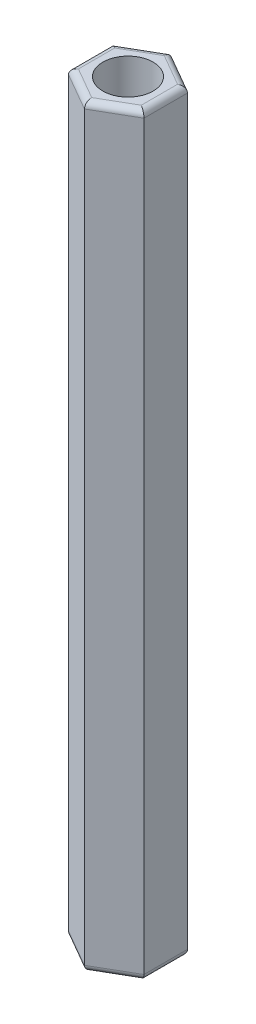
ISO-10303-21;
HEADER;
FILE_DESCRIPTION(('STEP AP214'),'2;1');
FILE_NAME('part.step','',(''),(''),'','','');
FILE_SCHEMA(('AUTOMOTIVE_DESIGN { 1 0 10303 214 1 1 1 1 }'));
ENDSEC;
DATA;
#1=APPLICATION_CONTEXT('core data for automotive mechanical design processes');
#2=APPLICATION_PROTOCOL_DEFINITION('international standard','automotive_design',2000,#1);
#3=PRODUCT_CONTEXT('',#1,'mechanical');
#4=PRODUCT('Part','Part','',(#3));
#5=PRODUCT_RELATED_PRODUCT_CATEGORY('part','',(#4));
#6=PRODUCT_DEFINITION_FORMATION('','',#4);
#7=PRODUCT_DEFINITION_CONTEXT('part definition',#1,'design');
#8=PRODUCT_DEFINITION('design','',#6,#7);
#9=PRODUCT_DEFINITION_SHAPE('','',#8);
#10=(LENGTH_UNIT() NAMED_UNIT(*) SI_UNIT(.MILLI.,.METRE.));
#11=(NAMED_UNIT(*) PLANE_ANGLE_UNIT() SI_UNIT($,.RADIAN.));
#12=(NAMED_UNIT(*) SI_UNIT($,.STERADIAN.) SOLID_ANGLE_UNIT());
#13=UNCERTAINTY_MEASURE_WITH_UNIT(LENGTH_MEASURE(1.E-05),#10,'distance_accuracy_value','');
#14=(GEOMETRIC_REPRESENTATION_CONTEXT(3) GLOBAL_UNCERTAINTY_ASSIGNED_CONTEXT((#13)) GLOBAL_UNIT_ASSIGNED_CONTEXT((#10,
#11,#12)) REPRESENTATION_CONTEXT('',''));
#15=CARTESIAN_POINT('',(0.,0.,0.));
#16=DIRECTION('',(0.,0.,1.));
#17=DIRECTION('',(1.,0.,0.));
#18=AXIS2_PLACEMENT_3D('',#15,#16,#17);
#19=CARTESIAN_POINT('',(0.,60.,0.));
#20=DIRECTION('',(0.,1.,0.));
#21=DIRECTION('',(0.,0.,1.));
#22=AXIS2_PLACEMENT_3D('',#19,#20,#21);
#23=PLANE('',#22);
#24=DIRECTION('',(0.,0.,1.));
#25=VECTOR('',#24,1.);
#26=CARTESIAN_POINT('',(-2.5,60.,1.73205080756888));
#27=LINE('',#26,#25);
#28=CARTESIAN_POINT('',(-2.5,60.,-1.44337567297407));
#29=VERTEX_POINT('',#28);
#30=CARTESIAN_POINT('',(-2.5,60.,1.44337567297406));
#31=VERTEX_POINT('',#30);
#32=EDGE_CURVE('E44',#29,#31,#27,.T.);
#33=ORIENTED_EDGE('',*,*,#32,.T.);
#34=DIRECTION('',(0.866025403784439,0.,0.5));
#35=VECTOR('',#34,1.);
#36=CARTESIAN_POINT('',(0.249999999999999,60.,3.03108891324554));
#37=LINE('',#36,#35);
#38=CARTESIAN_POINT('',(0.,60.,2.88675134594813));
#39=VERTEX_POINT('',#38);
#40=EDGE_CURVE('E11',#31,#39,#37,.T.);
#41=ORIENTED_EDGE('',*,*,#40,.T.);
#42=DIRECTION('',(0.866025403784439,0.,-0.5));
#43=VECTOR('',#42,1.);
#44=CARTESIAN_POINT('',(2.75,60.,1.29903810567666));
#45=LINE('',#44,#43);
#46=CARTESIAN_POINT('',(2.5,60.,1.44337567297406));
#47=VERTEX_POINT('',#46);
#48=EDGE_CURVE('E160',#39,#47,#45,.T.);
#49=ORIENTED_EDGE('',*,*,#48,.T.);
#50=DIRECTION('',(0.,0.,-1.));
#51=VECTOR('',#50,1.);
#52=CARTESIAN_POINT('',(2.5,60.,-1.73205080756888));
#53=LINE('',#52,#51);
#54=CARTESIAN_POINT('',(2.5,60.,-1.44337567297407));
#55=VERTEX_POINT('',#54);
#56=EDGE_CURVE('E257',#47,#55,#53,.T.);
#57=ORIENTED_EDGE('',*,*,#56,.T.);
#58=DIRECTION('',(-0.866025403784439,0.,-0.5));
#59=VECTOR('',#58,1.);
#60=CARTESIAN_POINT('',(-0.250000000000001,60.,-3.03108891324554));
#61=LINE('',#60,#59);
#62=CARTESIAN_POINT('',(0.,60.,-2.88675134594813));
#63=VERTEX_POINT('',#62);
#64=EDGE_CURVE('E259',#55,#63,#61,.T.);
#65=ORIENTED_EDGE('',*,*,#64,.T.);
#66=DIRECTION('',(-0.866025403784439,0.,0.5));
#67=VECTOR('',#66,1.);
#68=CARTESIAN_POINT('',(-2.75,60.,-1.29903810567666));
#69=LINE('',#68,#67);
#70=EDGE_CURVE('E55',#63,#29,#69,.T.);
#71=ORIENTED_EDGE('',*,*,#70,.T.);
#72=EDGE_LOOP('',(#33,#41,#49,#57,#65,#71));
#73=FACE_BOUND('',#72,.T.);
#74=CARTESIAN_POINT('',(0.,60.,0.));
#75=DIRECTION('',(0.,1.,0.));
#76=DIRECTION('',(0.,0.,1.));
#77=AXIS2_PLACEMENT_3D('',#74,#75,#76);
#78=CIRCLE('',#77,2.);
#79=CARTESIAN_POINT('',(0.,60.,2.));
#80=VERTEX_POINT('',#79);
#81=EDGE_CURVE('E149',#80,#80,#78,.T.);
#82=ORIENTED_EDGE('',*,*,#81,.F.);
#83=EDGE_LOOP('',(#82));
#84=FACE_BOUND('',#83,.T.);
#85=ADVANCED_FACE('F35',(#73,#84),#23,.T.);
#86=CARTESIAN_POINT('',(0.,0.,0.));
#87=DIRECTION('',(0.,1.,0.));
#88=DIRECTION('',(0.,0.,1.));
#89=AXIS2_PLACEMENT_3D('',#86,#87,#88);
#90=PLANE('',#89);
#91=DIRECTION('',(0.866025403784439,0.,-0.5));
#92=VECTOR('',#91,1.);
#93=CARTESIAN_POINT('',(1.25,0.,2.1650635094611));
#94=LINE('',#93,#92);
#95=CARTESIAN_POINT('',(2.5,0.,1.44337567297406));
#96=VERTEX_POINT('',#95);
#97=CARTESIAN_POINT('',(0.,0.,2.88675134594813));
#98=VERTEX_POINT('',#97);
#99=EDGE_CURVE('E235',#96,#98,#94,.F.);
#100=ORIENTED_EDGE('',*,*,#99,.T.);
#101=DIRECTION('',(0.866025403784439,0.,0.5));
#102=VECTOR('',#101,1.);
#103=CARTESIAN_POINT('',(-1.25,0.,2.1650635094611));
#104=LINE('',#103,#102);
#105=CARTESIAN_POINT('',(-2.5,0.,1.44337567297406));
#106=VERTEX_POINT('',#105);
#107=EDGE_CURVE('E136',#98,#106,#104,.F.);
#108=ORIENTED_EDGE('',*,*,#107,.T.);
#109=DIRECTION('',(0.,0.,1.));
#110=VECTOR('',#109,1.);
#111=CARTESIAN_POINT('',(-2.5,0.,0.));
#112=LINE('',#111,#110);
#113=CARTESIAN_POINT('',(-2.5,0.,-1.44337567297407));
#114=VERTEX_POINT('',#113);
#115=EDGE_CURVE('E227',#106,#114,#112,.F.);
#116=ORIENTED_EDGE('',*,*,#115,.T.);
#117=DIRECTION('',(-0.866025403784439,0.,0.5));
#118=VECTOR('',#117,1.);
#119=CARTESIAN_POINT('',(-1.25,0.,-2.1650635094611));
#120=LINE('',#119,#118);
#121=CARTESIAN_POINT('',(0.,0.,-2.88675134594813));
#122=VERTEX_POINT('',#121);
#123=EDGE_CURVE('E229',#114,#122,#120,.F.);
#124=ORIENTED_EDGE('',*,*,#123,.T.);
#125=DIRECTION('',(-0.866025403784439,0.,-0.5));
#126=VECTOR('',#125,1.);
#127=CARTESIAN_POINT('',(1.25,0.,-2.1650635094611));
#128=LINE('',#127,#126);
#129=CARTESIAN_POINT('',(2.5,0.,-1.44337567297407));
#130=VERTEX_POINT('',#129);
#131=EDGE_CURVE('E231',#122,#130,#128,.F.);
#132=ORIENTED_EDGE('',*,*,#131,.T.);
#133=DIRECTION('',(0.,0.,-1.));
#134=VECTOR('',#133,1.);
#135=CARTESIAN_POINT('',(2.5,0.,0.));
#136=LINE('',#135,#134);
#137=EDGE_CURVE('E233',#130,#96,#136,.F.);
#138=ORIENTED_EDGE('',*,*,#137,.T.);
#139=EDGE_LOOP('',(#100,#108,#116,#124,#132,#138));
#140=FACE_BOUND('',#139,.T.);
#141=CARTESIAN_POINT('',(0.,0.,0.));
#142=DIRECTION('',(0.,1.,0.));
#143=DIRECTION('',(0.,0.,1.));
#144=AXIS2_PLACEMENT_3D('',#141,#142,#143);
#145=CIRCLE('',#144,2.);
#146=CARTESIAN_POINT('',(0.,0.,2.));
#147=VERTEX_POINT('',#146);
#148=EDGE_CURVE('E203',#147,#147,#145,.T.);
#149=ORIENTED_EDGE('',*,*,#148,.T.);
#150=EDGE_LOOP('',(#149));
#151=FACE_BOUND('',#150,.T.);
#152=ADVANCED_FACE('F303',(#140,#151),#90,.F.);
#153=CARTESIAN_POINT('',(0.,60.,3.46410161513776));
#154=DIRECTION('',(-0.5,0.,-0.866025403784438));
#155=DIRECTION('',(-0.866025403784439,0.,0.5));
#156=AXIS2_PLACEMENT_3D('',#153,#154,#155);
#157=PLANE('',#156);
#158=DIRECTION('',(0.,-1.,0.));
#159=VECTOR('',#158,1.);
#160=CARTESIAN_POINT('',(0.,60.,3.46410161513776));
#161=LINE('',#160,#159);
#162=CARTESIAN_POINT('',(0.,59.5,3.46410161513776));
#163=VERTEX_POINT('',#162);
#164=CARTESIAN_POINT('',(0.,0.5,3.46410161513776));
#165=VERTEX_POINT('',#164);
#166=EDGE_CURVE('E128',#163,#165,#161,.T.);
#167=ORIENTED_EDGE('',*,*,#166,.T.);
#168=DIRECTION('',(0.866025403784439,0.,-0.5));
#169=VECTOR('',#168,1.);
#170=CARTESIAN_POINT('',(0.,0.5,3.46410161513776));
#171=LINE('',#170,#169);
#172=CARTESIAN_POINT('',(3.,0.5,1.73205080756888));
#173=VERTEX_POINT('',#172);
#174=EDGE_CURVE('E135',#165,#173,#171,.T.);
#175=ORIENTED_EDGE('',*,*,#174,.T.);
#176=DIRECTION('',(0.,-1.,0.));
#177=VECTOR('',#176,1.);
#178=CARTESIAN_POINT('',(3.,60.,1.73205080756888));
#179=LINE('',#178,#177);
#180=CARTESIAN_POINT('',(3.,59.5,1.73205080756888));
#181=VERTEX_POINT('',#180);
#182=EDGE_CURVE('E130',#181,#173,#179,.T.);
#183=ORIENTED_EDGE('',*,*,#182,.F.);
#184=DIRECTION('',(0.866025403784439,0.,-0.5));
#185=VECTOR('',#184,1.);
#186=CARTESIAN_POINT('',(0.,59.5,3.46410161513776));
#187=LINE('',#186,#185);
#188=EDGE_CURVE('E125',#181,#163,#187,.F.);
#189=ORIENTED_EDGE('',*,*,#188,.T.);
#190=EDGE_LOOP('',(#167,#175,#183,#189));
#191=FACE_BOUND('',#190,.T.);
#192=ADVANCED_FACE('F127',(#191),#157,.F.);
#193=CARTESIAN_POINT('',(3.,60.,1.73205080756888));
#194=DIRECTION('',(-1.,0.,0.));
#195=DIRECTION('',(0.,0.,1.));
#196=AXIS2_PLACEMENT_3D('',#193,#194,#195);
#197=PLANE('',#196);
#198=ORIENTED_EDGE('',*,*,#182,.T.);
#199=DIRECTION('',(0.,0.,-1.));
#200=VECTOR('',#199,1.);
#201=CARTESIAN_POINT('',(3.,0.5,1.73205080756888));
#202=LINE('',#201,#200);
#203=CARTESIAN_POINT('',(3.,0.5,-1.73205080756888));
#204=VERTEX_POINT('',#203);
#205=EDGE_CURVE('E242',#173,#204,#202,.T.);
#206=ORIENTED_EDGE('',*,*,#205,.T.);
#207=DIRECTION('',(0.,-1.,0.));
#208=VECTOR('',#207,1.);
#209=CARTESIAN_POINT('',(3.,60.,-1.73205080756888));
#210=LINE('',#209,#208);
#211=CARTESIAN_POINT('',(3.,59.5,-1.73205080756888));
#212=VERTEX_POINT('',#211);
#213=EDGE_CURVE('E222',#212,#204,#210,.T.);
#214=ORIENTED_EDGE('',*,*,#213,.F.);
#215=DIRECTION('',(0.,0.,-1.));
#216=VECTOR('',#215,1.);
#217=CARTESIAN_POINT('',(3.,59.5,1.73205080756888));
#218=LINE('',#217,#216);
#219=EDGE_CURVE('E240',#212,#181,#218,.F.);
#220=ORIENTED_EDGE('',*,*,#219,.T.);
#221=EDGE_LOOP('',(#198,#206,#214,#220));
#222=FACE_BOUND('',#221,.T.);
#223=ADVANCED_FACE('F271',(#222),#197,.F.);
#224=CARTESIAN_POINT('',(3.,60.,-1.73205080756888));
#225=DIRECTION('',(-0.5,0.,0.866025403784438));
#226=DIRECTION('',(0.866025403784439,0.,0.5));
#227=AXIS2_PLACEMENT_3D('',#224,#225,#226);
#228=PLANE('',#227);
#229=ORIENTED_EDGE('',*,*,#213,.T.);
#230=DIRECTION('',(-0.866025403784439,0.,-0.5));
#231=VECTOR('',#230,1.);
#232=CARTESIAN_POINT('',(3.,0.5,-1.73205080756888));
#233=LINE('',#232,#231);
#234=CARTESIAN_POINT('',(0.,0.5,-3.46410161513776));
#235=VERTEX_POINT('',#234);
#236=EDGE_CURVE('E246',#204,#235,#233,.T.);
#237=ORIENTED_EDGE('',*,*,#236,.T.);
#238=DIRECTION('',(0.,-1.,0.));
#239=VECTOR('',#238,1.);
#240=CARTESIAN_POINT('',(0.,60.,-3.46410161513776));
#241=LINE('',#240,#239);
#242=CARTESIAN_POINT('',(0.,59.5,-3.46410161513776));
#243=VERTEX_POINT('',#242);
#244=EDGE_CURVE('E219',#243,#235,#241,.T.);
#245=ORIENTED_EDGE('',*,*,#244,.F.);
#246=DIRECTION('',(-0.866025403784439,0.,-0.5));
#247=VECTOR('',#246,1.);
#248=CARTESIAN_POINT('',(3.,59.5,-1.73205080756888));
#249=LINE('',#248,#247);
#250=EDGE_CURVE('E244',#243,#212,#249,.F.);
#251=ORIENTED_EDGE('',*,*,#250,.T.);
#252=EDGE_LOOP('',(#229,#237,#245,#251));
#253=FACE_BOUND('',#252,.T.);
#254=ADVANCED_FACE('F274',(#253),#228,.F.);
#255=CARTESIAN_POINT('',(0.,60.,-3.46410161513776));
#256=DIRECTION('',(0.5,0.,0.866025403784439));
#257=DIRECTION('',(0.866025403784439,0.,-0.5));
#258=AXIS2_PLACEMENT_3D('',#255,#256,#257);
#259=PLANE('',#258);
#260=ORIENTED_EDGE('',*,*,#244,.T.);
#261=DIRECTION('',(-0.866025403784439,0.,0.5));
#262=VECTOR('',#261,1.);
#263=CARTESIAN_POINT('',(0.,0.5,-3.46410161513776));
#264=LINE('',#263,#262);
#265=CARTESIAN_POINT('',(-3.,0.5,-1.73205080756888));
#266=VERTEX_POINT('',#265);
#267=EDGE_CURVE('E250',#235,#266,#264,.T.);
#268=ORIENTED_EDGE('',*,*,#267,.T.);
#269=DIRECTION('',(0.,-1.,0.));
#270=VECTOR('',#269,1.);
#271=CARTESIAN_POINT('',(-3.,60.,-1.73205080756888));
#272=LINE('',#271,#270);
#273=CARTESIAN_POINT('',(-3.,59.5,-1.73205080756888));
#274=VERTEX_POINT('',#273);
#275=EDGE_CURVE('E216',#274,#266,#272,.T.);
#276=ORIENTED_EDGE('',*,*,#275,.F.);
#277=DIRECTION('',(-0.866025403784439,0.,0.5));
#278=VECTOR('',#277,1.);
#279=CARTESIAN_POINT('',(0.,59.5,-3.46410161513776));
#280=LINE('',#279,#278);
#281=EDGE_CURVE('E248',#274,#243,#280,.F.);
#282=ORIENTED_EDGE('',*,*,#281,.T.);
#283=EDGE_LOOP('',(#260,#268,#276,#282));
#284=FACE_BOUND('',#283,.T.);
#285=ADVANCED_FACE('F284',(#284),#259,.F.);
#286=CARTESIAN_POINT('',(-3.,60.,-1.73205080756888));
#287=DIRECTION('',(1.,0.,0.));
#288=DIRECTION('',(0.,0.,-1.));
#289=AXIS2_PLACEMENT_3D('',#286,#287,#288);
#290=PLANE('',#289);
#291=ORIENTED_EDGE('',*,*,#275,.T.);
#292=DIRECTION('',(0.,0.,1.));
#293=VECTOR('',#292,1.);
#294=CARTESIAN_POINT('',(-3.,0.5,-1.73205080756888));
#295=LINE('',#294,#293);
#296=CARTESIAN_POINT('',(-3.,0.5,1.73205080756888));
#297=VERTEX_POINT('',#296);
#298=EDGE_CURVE('E254',#266,#297,#295,.T.);
#299=ORIENTED_EDGE('',*,*,#298,.T.);
#300=DIRECTION('',(0.,-1.,0.));
#301=VECTOR('',#300,1.);
#302=CARTESIAN_POINT('',(-3.,60.,1.73205080756888));
#303=LINE('',#302,#301);
#304=CARTESIAN_POINT('',(-3.,59.5,1.73205080756888));
#305=VERTEX_POINT('',#304);
#306=EDGE_CURVE('E148',#305,#297,#303,.T.);
#307=ORIENTED_EDGE('',*,*,#306,.F.);
#308=DIRECTION('',(0.,0.,1.));
#309=VECTOR('',#308,1.);
#310=CARTESIAN_POINT('',(-3.,59.5,-1.73205080756888));
#311=LINE('',#310,#309);
#312=EDGE_CURVE('E252',#305,#274,#311,.F.);
#313=ORIENTED_EDGE('',*,*,#312,.T.);
#314=EDGE_LOOP('',(#291,#299,#307,#313));
#315=FACE_BOUND('',#314,.T.);
#316=ADVANCED_FACE('F286',(#315),#290,.F.);
#317=CARTESIAN_POINT('',(-3.,60.,1.73205080756888));
#318=DIRECTION('',(0.5,0.,-0.866025403784438));
#319=DIRECTION('',(-0.866025403784439,0.,-0.5));
#320=AXIS2_PLACEMENT_3D('',#317,#318,#319);
#321=PLANE('',#320);
#322=ORIENTED_EDGE('',*,*,#306,.T.);
#323=DIRECTION('',(0.866025403784439,0.,0.5));
#324=VECTOR('',#323,1.);
#325=CARTESIAN_POINT('',(-3.,0.5,1.73205080756888));
#326=LINE('',#325,#324);
#327=EDGE_CURVE('E147',#297,#165,#326,.T.);
#328=ORIENTED_EDGE('',*,*,#327,.T.);
#329=ORIENTED_EDGE('',*,*,#166,.F.);
#330=DIRECTION('',(0.866025403784439,0.,0.5));
#331=VECTOR('',#330,1.);
#332=CARTESIAN_POINT('',(-3.,59.5,1.73205080756888));
#333=LINE('',#332,#331);
#334=EDGE_CURVE('E144',#163,#305,#333,.F.);
#335=ORIENTED_EDGE('',*,*,#334,.T.);
#336=EDGE_LOOP('',(#322,#328,#329,#335));
#337=FACE_BOUND('',#336,.T.);
#338=ADVANCED_FACE('F143',(#337),#321,.F.);
#339=CARTESIAN_POINT('',(0.,60.,0.));
#340=DIRECTION('',(0.,-1.,0.));
#341=DIRECTION('',(0.,0.,-1.));
#342=AXIS2_PLACEMENT_3D('',#339,#340,#341);
#343=CYLINDRICAL_SURFACE('',#342,2.);
#344=ORIENTED_EDGE('',*,*,#81,.T.);
#345=EDGE_LOOP('',(#344));
#346=FACE_BOUND('',#345,.T.);
#347=ORIENTED_EDGE('',*,*,#148,.F.);
#348=EDGE_LOOP('',(#347));
#349=FACE_BOUND('',#348,.T.);
#350=ADVANCED_FACE('F311',(#346,#349),#343,.F.);
#351=CARTESIAN_POINT('',(2.75,0.5,-1.29903810567666));
#352=DIRECTION('',(-0.866025403784439,0.,-0.5));
#353=DIRECTION('',(-0.5,0.,0.866025403784438));
#354=AXIS2_PLACEMENT_3D('',#351,#352,#353);
#355=CYLINDRICAL_SURFACE('',#354,0.5);
#356=CARTESIAN_POINT('',(2.5,0.5,-1.44337567297407));
#357=DIRECTION('',(-0.5,0.,-0.866025403784439));
#358=DIRECTION('',(-0.866025403784439,0.,0.5));
#359=AXIS2_PLACEMENT_3D('',#356,#357,#358);
#360=ELLIPSE('',#359,0.577350269189626,0.5);
#361=EDGE_CURVE('E196',#130,#204,#360,.F.);
#362=ORIENTED_EDGE('',*,*,#361,.F.);
#363=ORIENTED_EDGE('',*,*,#131,.F.);
#364=CARTESIAN_POINT('',(0.,0.5,-2.88675134594813));
#365=DIRECTION('',(-1.,0.,0.));
#366=DIRECTION('',(0.,0.,1.));
#367=AXIS2_PLACEMENT_3D('',#364,#365,#366);
#368=ELLIPSE('',#367,0.577350269189626,0.5);
#369=EDGE_CURVE('E165',#235,#122,#368,.T.);
#370=ORIENTED_EDGE('',*,*,#369,.F.);
#371=ORIENTED_EDGE('',*,*,#236,.F.);
#372=EDGE_LOOP('',(#362,#363,#370,#371));
#373=FACE_BOUND('',#372,.T.);
#374=ADVANCED_FACE('F277',(#373),#355,.T.);
#375=CARTESIAN_POINT('',(0.25,0.5,-3.03108891324554));
#376=DIRECTION('',(-0.866025403784439,0.,0.5));
#377=DIRECTION('',(0.5,0.,0.866025403784439));
#378=AXIS2_PLACEMENT_3D('',#375,#376,#377);
#379=CYLINDRICAL_SURFACE('',#378,0.5);
#380=ORIENTED_EDGE('',*,*,#369,.T.);
#381=ORIENTED_EDGE('',*,*,#123,.F.);
#382=CARTESIAN_POINT('',(-2.5,0.5,-1.44337567297407));
#383=DIRECTION('',(-0.5,0.,0.866025403784439));
#384=DIRECTION('',(0.866025403784439,0.,0.5));
#385=AXIS2_PLACEMENT_3D('',#382,#383,#384);
#386=ELLIPSE('',#385,0.577350269189626,0.5);
#387=EDGE_CURVE('E194',#266,#114,#386,.T.);
#388=ORIENTED_EDGE('',*,*,#387,.F.);
#389=ORIENTED_EDGE('',*,*,#267,.F.);
#390=EDGE_LOOP('',(#380,#381,#388,#389));
#391=FACE_BOUND('',#390,.T.);
#392=ADVANCED_FACE('F280',(#391),#379,.T.);
#393=CARTESIAN_POINT('',(2.5,0.5,1.73205080756888));
#394=DIRECTION('',(0.,0.,-1.));
#395=DIRECTION('',(-1.,0.,0.));
#396=AXIS2_PLACEMENT_3D('',#393,#394,#395);
#397=CYLINDRICAL_SURFACE('',#396,0.5);
#398=ORIENTED_EDGE('',*,*,#361,.T.);
#399=ORIENTED_EDGE('',*,*,#205,.F.);
#400=CARTESIAN_POINT('',(2.5,0.5,1.44337567297406));
#401=DIRECTION('',(0.5,0.,-0.866025403784439));
#402=DIRECTION('',(-0.866025403784439,0.,-0.5));
#403=AXIS2_PLACEMENT_3D('',#400,#401,#402);
#404=ELLIPSE('',#403,0.577350269189626,0.5);
#405=EDGE_CURVE('E188',#96,#173,#404,.F.);
#406=ORIENTED_EDGE('',*,*,#405,.F.);
#407=ORIENTED_EDGE('',*,*,#137,.F.);
#408=EDGE_LOOP('',(#398,#399,#406,#407));
#409=FACE_BOUND('',#408,.T.);
#410=ADVANCED_FACE('F365',(#409),#397,.T.);
#411=CARTESIAN_POINT('',(-2.5,0.5,-1.73205080756888));
#412=DIRECTION('',(0.,0.,1.));
#413=DIRECTION('',(1.,0.,0.));
#414=AXIS2_PLACEMENT_3D('',#411,#412,#413);
#415=CYLINDRICAL_SURFACE('',#414,0.5);
#416=ORIENTED_EDGE('',*,*,#387,.T.);
#417=ORIENTED_EDGE('',*,*,#115,.F.);
#418=CARTESIAN_POINT('',(-2.5,0.5,1.44337567297406));
#419=DIRECTION('',(0.5,0.,0.866025403784439));
#420=DIRECTION('',(-0.866025403784439,0.,0.5));
#421=AXIS2_PLACEMENT_3D('',#418,#419,#420);
#422=ELLIPSE('',#421,0.577350269189626,0.5);
#423=EDGE_CURVE('E182',#297,#106,#422,.T.);
#424=ORIENTED_EDGE('',*,*,#423,.F.);
#425=ORIENTED_EDGE('',*,*,#298,.F.);
#426=EDGE_LOOP('',(#416,#417,#424,#425));
#427=FACE_BOUND('',#426,.T.);
#428=ADVANCED_FACE('F290',(#427),#415,.T.);
#429=CARTESIAN_POINT('',(-0.250000000000001,0.5,3.03108891324554));
#430=DIRECTION('',(0.866025403784439,0.,-0.5));
#431=DIRECTION('',(-0.5,0.,-0.866025403784439));
#432=AXIS2_PLACEMENT_3D('',#429,#430,#431);
#433=CYLINDRICAL_SURFACE('',#432,0.5);
#434=ORIENTED_EDGE('',*,*,#405,.T.);
#435=ORIENTED_EDGE('',*,*,#174,.F.);
#436=CARTESIAN_POINT('',(0.,0.5,2.88675134594813));
#437=DIRECTION('',(1.,0.,0.));
#438=DIRECTION('',(0.,0.,-1.));
#439=AXIS2_PLACEMENT_3D('',#436,#437,#438);
#440=ELLIPSE('',#439,0.577350269189626,0.5);
#441=EDGE_CURVE('E178',#98,#165,#440,.F.);
#442=ORIENTED_EDGE('',*,*,#441,.F.);
#443=ORIENTED_EDGE('',*,*,#99,.F.);
#444=EDGE_LOOP('',(#434,#435,#442,#443));
#445=FACE_BOUND('',#444,.T.);
#446=ADVANCED_FACE('F293',(#445),#433,.T.);
#447=CARTESIAN_POINT('',(-2.75,0.5,1.29903810567666));
#448=DIRECTION('',(0.866025403784439,0.,0.5));
#449=DIRECTION('',(0.5,0.,-0.866025403784438));
#450=AXIS2_PLACEMENT_3D('',#447,#448,#449);
#451=CYLINDRICAL_SURFACE('',#450,0.5);
#452=ORIENTED_EDGE('',*,*,#423,.T.);
#453=ORIENTED_EDGE('',*,*,#107,.F.);
#454=ORIENTED_EDGE('',*,*,#441,.T.);
#455=ORIENTED_EDGE('',*,*,#327,.F.);
#456=EDGE_LOOP('',(#452,#453,#454,#455));
#457=FACE_BOUND('',#456,.T.);
#458=ADVANCED_FACE('F291',(#457),#451,.T.);
#459=CARTESIAN_POINT('',(1.25,59.5,-2.1650635094611));
#460=DIRECTION('',(0.866025403784439,0.,0.5));
#461=DIRECTION('',(0.5,0.,-0.866025403784438));
#462=AXIS2_PLACEMENT_3D('',#459,#460,#461);
#463=CYLINDRICAL_SURFACE('',#462,0.5);
#464=CARTESIAN_POINT('',(2.5,59.5,-1.44337567297406));
#465=DIRECTION('',(0.5,0.,0.866025403784439));
#466=DIRECTION('',(-0.866025403784439,0.,0.5));
#467=AXIS2_PLACEMENT_3D('',#464,#465,#466);
#468=ELLIPSE('',#467,0.577350269189626,0.5);
#469=EDGE_CURVE('E171',#212,#55,#468,.T.);
#470=ORIENTED_EDGE('',*,*,#469,.F.);
#471=ORIENTED_EDGE('',*,*,#250,.F.);
#472=CARTESIAN_POINT('',(0.,59.5,-2.88675134594813));
#473=DIRECTION('',(1.,0.,0.));
#474=DIRECTION('',(0.,0.,1.));
#475=AXIS2_PLACEMENT_3D('',#472,#473,#474);
#476=ELLIPSE('',#475,0.577350269189626,0.5);
#477=EDGE_CURVE('E39',#63,#243,#476,.F.);
#478=ORIENTED_EDGE('',*,*,#477,.F.);
#479=ORIENTED_EDGE('',*,*,#64,.F.);
#480=EDGE_LOOP('',(#470,#471,#478,#479));
#481=FACE_BOUND('',#480,.T.);
#482=ADVANCED_FACE('F37',(#481),#463,.T.);
#483=CARTESIAN_POINT('',(-1.25,59.5,-2.1650635094611));
#484=DIRECTION('',(0.866025403784439,0.,-0.5));
#485=DIRECTION('',(-0.5,0.,-0.866025403784439));
#486=AXIS2_PLACEMENT_3D('',#483,#484,#485);
#487=CYLINDRICAL_SURFACE('',#486,0.5);
#488=ORIENTED_EDGE('',*,*,#477,.T.);
#489=ORIENTED_EDGE('',*,*,#281,.F.);
#490=CARTESIAN_POINT('',(-2.5,59.5,-1.44337567297407));
#491=DIRECTION('',(0.5,0.,-0.866025403784439));
#492=DIRECTION('',(0.866025403784439,0.,0.5));
#493=AXIS2_PLACEMENT_3D('',#490,#491,#492);
#494=ELLIPSE('',#493,0.577350269189626,0.5);
#495=EDGE_CURVE('E169',#29,#274,#494,.F.);
#496=ORIENTED_EDGE('',*,*,#495,.F.);
#497=ORIENTED_EDGE('',*,*,#70,.F.);
#498=EDGE_LOOP('',(#488,#489,#496,#497));
#499=FACE_BOUND('',#498,.T.);
#500=ADVANCED_FACE('F265',(#499),#487,.T.);
#501=CARTESIAN_POINT('',(2.5,59.5,0.));
#502=DIRECTION('',(0.,0.,1.));
#503=DIRECTION('',(1.,0.,0.));
#504=AXIS2_PLACEMENT_3D('',#501,#502,#503);
#505=CYLINDRICAL_SURFACE('',#504,0.5);
#506=ORIENTED_EDGE('',*,*,#469,.T.);
#507=ORIENTED_EDGE('',*,*,#56,.F.);
#508=CARTESIAN_POINT('',(2.5,59.5,1.44337567297407));
#509=DIRECTION('',(-0.5,0.,0.866025403784439));
#510=DIRECTION('',(-0.866025403784439,0.,-0.5));
#511=AXIS2_PLACEMENT_3D('',#508,#509,#510);
#512=ELLIPSE('',#511,0.577350269189626,0.5);
#513=EDGE_CURVE('E162',#181,#47,#512,.T.);
#514=ORIENTED_EDGE('',*,*,#513,.F.);
#515=ORIENTED_EDGE('',*,*,#219,.F.);
#516=EDGE_LOOP('',(#506,#507,#514,#515));
#517=FACE_BOUND('',#516,.T.);
#518=ADVANCED_FACE('F268',(#517),#505,.T.);
#519=CARTESIAN_POINT('',(-2.5,59.5,0.));
#520=DIRECTION('',(0.,0.,-1.));
#521=DIRECTION('',(-1.,0.,0.));
#522=AXIS2_PLACEMENT_3D('',#519,#520,#521);
#523=CYLINDRICAL_SURFACE('',#522,0.5);
#524=ORIENTED_EDGE('',*,*,#495,.T.);
#525=ORIENTED_EDGE('',*,*,#312,.F.);
#526=CARTESIAN_POINT('',(-2.5,59.5,1.44337567297406));
#527=DIRECTION('',(-0.5,0.,-0.866025403784439));
#528=DIRECTION('',(0.866025403784439,0.,-0.5));
#529=AXIS2_PLACEMENT_3D('',#526,#527,#528);
#530=ELLIPSE('',#529,0.577350269189626,0.5);
#531=EDGE_CURVE('E156',#31,#305,#530,.F.);
#532=ORIENTED_EDGE('',*,*,#531,.F.);
#533=ORIENTED_EDGE('',*,*,#32,.F.);
#534=EDGE_LOOP('',(#524,#525,#532,#533));
#535=FACE_BOUND('',#534,.T.);
#536=ADVANCED_FACE('F267',(#535),#523,.T.);
#537=CARTESIAN_POINT('',(1.25,59.5,2.1650635094611));
#538=DIRECTION('',(-0.866025403784439,0.,0.5));
#539=DIRECTION('',(0.5,0.,0.866025403784439));
#540=AXIS2_PLACEMENT_3D('',#537,#538,#539);
#541=CYLINDRICAL_SURFACE('',#540,0.5);
#542=ORIENTED_EDGE('',*,*,#513,.T.);
#543=ORIENTED_EDGE('',*,*,#48,.F.);
#544=CARTESIAN_POINT('',(0.,59.5,2.88675134594813));
#545=DIRECTION('',(-1.,0.,0.));
#546=DIRECTION('',(0.,0.,1.));
#547=AXIS2_PLACEMENT_3D('',#544,#545,#546);
#548=ELLIPSE('',#547,0.577350269189626,0.5);
#549=EDGE_CURVE('E154',#163,#39,#548,.T.);
#550=ORIENTED_EDGE('',*,*,#549,.F.);
#551=ORIENTED_EDGE('',*,*,#188,.F.);
#552=EDGE_LOOP('',(#542,#543,#550,#551));
#553=FACE_BOUND('',#552,.T.);
#554=ADVANCED_FACE('F159',(#553),#541,.T.);
#555=CARTESIAN_POINT('',(-1.25,59.5,2.1650635094611));
#556=DIRECTION('',(-0.866025403784439,0.,-0.5));
#557=DIRECTION('',(-0.5,0.,0.866025403784438));
#558=AXIS2_PLACEMENT_3D('',#555,#556,#557);
#559=CYLINDRICAL_SURFACE('',#558,0.5);
#560=ORIENTED_EDGE('',*,*,#531,.T.);
#561=ORIENTED_EDGE('',*,*,#334,.F.);
#562=ORIENTED_EDGE('',*,*,#549,.T.);
#563=ORIENTED_EDGE('',*,*,#40,.F.);
#564=EDGE_LOOP('',(#560,#561,#562,#563));
#565=FACE_BOUND('',#564,.T.);
#566=ADVANCED_FACE('F152',(#565),#559,.T.);
#567=CLOSED_SHELL('',(#85,#152,#192,#223,#254,#285,#316,#338,#350,#374,#392,#410,#428,#446,#458,
#482,#500,#518,#536,#554,#566));
#568=MANIFOLD_SOLID_BREP('B2',#567);
#569=ADVANCED_BREP_SHAPE_REPRESENTATION('',(#18,#568),#14);
#570=SHAPE_DEFINITION_REPRESENTATION(#9,#569);
ENDSEC;
END-ISO-10303-21;
